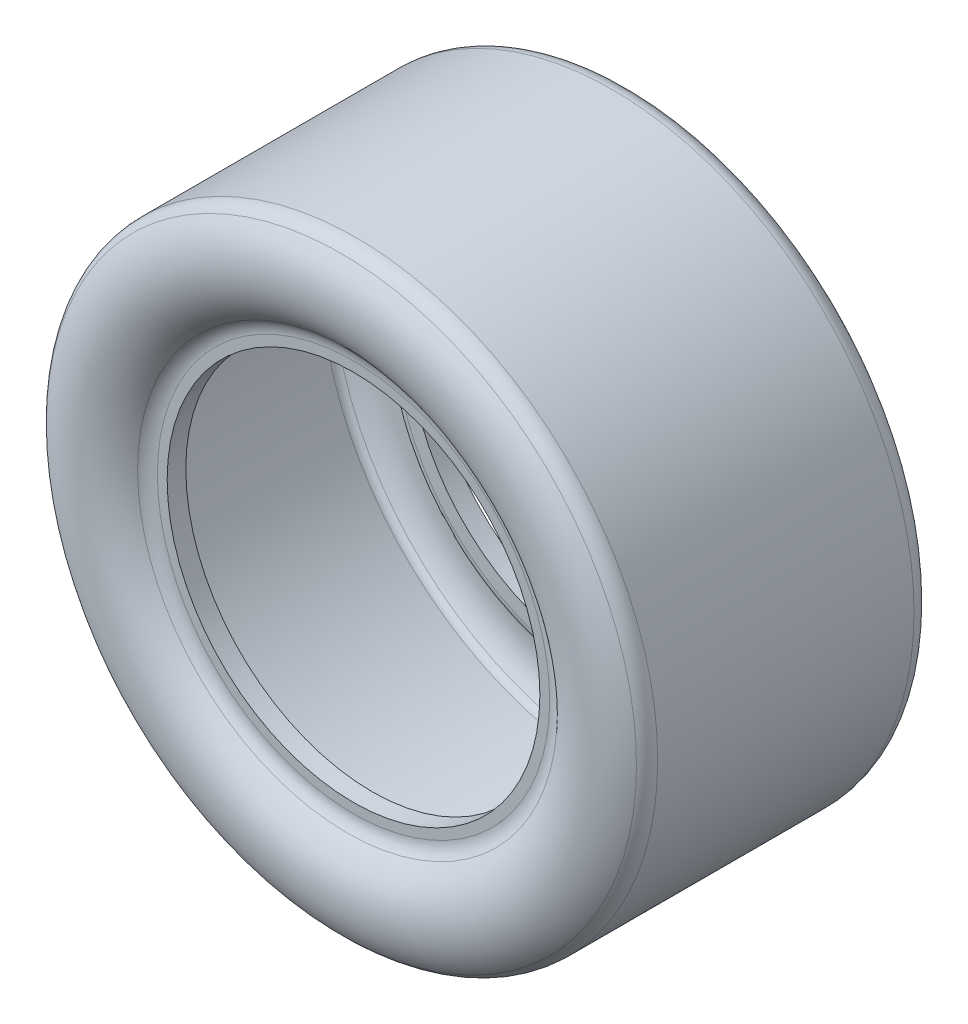
ISO-10303-21;
HEADER;
FILE_DESCRIPTION(('STEP AP214'),'2;1');
FILE_NAME('part.step','',(''),(''),'','','');
FILE_SCHEMA(('AUTOMOTIVE_DESIGN { 1 0 10303 214 1 1 1 1 }'));
ENDSEC;
DATA;
#1=APPLICATION_CONTEXT('core data for automotive mechanical design processes');
#2=APPLICATION_PROTOCOL_DEFINITION('international standard','automotive_design',2000,#1);
#3=PRODUCT_CONTEXT('',#1,'mechanical');
#4=PRODUCT('Part','Part','',(#3));
#5=PRODUCT_RELATED_PRODUCT_CATEGORY('part','',(#4));
#6=PRODUCT_DEFINITION_FORMATION('','',#4);
#7=PRODUCT_DEFINITION_CONTEXT('part definition',#1,'design');
#8=PRODUCT_DEFINITION('design','',#6,#7);
#9=PRODUCT_DEFINITION_SHAPE('','',#8);
#10=(LENGTH_UNIT() NAMED_UNIT(*) SI_UNIT(.MILLI.,.METRE.));
#11=(NAMED_UNIT(*) PLANE_ANGLE_UNIT() SI_UNIT($,.RADIAN.));
#12=(NAMED_UNIT(*) SI_UNIT($,.STERADIAN.) SOLID_ANGLE_UNIT());
#13=UNCERTAINTY_MEASURE_WITH_UNIT(LENGTH_MEASURE(1.E-05),#10,'distance_accuracy_value','');
#14=(GEOMETRIC_REPRESENTATION_CONTEXT(3) GLOBAL_UNCERTAINTY_ASSIGNED_CONTEXT((#13)) GLOBAL_UNIT_ASSIGNED_CONTEXT((#10,
#11,#12)) REPRESENTATION_CONTEXT('',''));
#15=CARTESIAN_POINT('',(0.,0.,0.));
#16=DIRECTION('',(0.,0.,1.));
#17=DIRECTION('',(1.,0.,0.));
#18=AXIS2_PLACEMENT_3D('',#15,#16,#17);
#19=CARTESIAN_POINT('',(0.,0.,64.4017));
#20=DIRECTION('',(0.,0.,-1.));
#21=DIRECTION('',(-1.,0.,0.));
#22=AXIS2_PLACEMENT_3D('',#19,#20,#21);
#23=TOROIDAL_SURFACE('',#22,174.243267307692,42.3486011478618);
#24=CARTESIAN_POINT('',(0.,0.,97.1518352972636));
#25=DIRECTION('',(0.,0.,-1.));
#26=DIRECTION('',(-1.,0.,0.));
#27=AXIS2_PLACEMENT_3D('',#24,#25,#26);
#28=CIRCLE('',#27,201.091594205129);
#29=CARTESIAN_POINT('',(-201.091594205129,0.,97.1518352972636));
#30=VERTEX_POINT('',#29);
#31=EDGE_CURVE('E47',#30,#30,#28,.F.);
#32=ORIENTED_EDGE('',*,*,#31,.T.);
#33=EDGE_LOOP('',(#32));
#34=FACE_BOUND('',#33,.T.);
#35=CARTESIAN_POINT('',(0.,0.,93.0181577706021));
#36=DIRECTION('',(0.,0.,-1.));
#37=DIRECTION('',(-1.,0.,0.));
#38=AXIS2_PLACEMENT_3D('',#35,#36,#37);
#39=CIRCLE('',#38,143.026246888632);
#40=CARTESIAN_POINT('',(-143.026246888632,0.,93.0181577706021));
#41=VERTEX_POINT('',#40);
#42=EDGE_CURVE('E51',#41,#41,#39,.T.);
#43=ORIENTED_EDGE('',*,*,#42,.T.);
#44=EDGE_LOOP('',(#43));
#45=FACE_BOUND('',#44,.T.);
#46=ADVANCED_FACE('F36',(#34,#45),#23,.T.);
#47=CARTESIAN_POINT('',(0.,127.,88.9));
#48=DIRECTION('',(0.,0.,1.));
#49=DIRECTION('',(1.,0.,0.));
#50=AXIS2_PLACEMENT_3D('',#47,#48,#49);
#51=PLANE('',#50);
#52=CARTESIAN_POINT('',(0.,0.,88.9));
#53=DIRECTION('',(0.,0.,1.));
#54=DIRECTION('',(1.,0.,0.));
#55=AXIS2_PLACEMENT_3D('',#52,#53,#54);
#56=CIRCLE('',#55,133.664517136619);
#57=CARTESIAN_POINT('',(133.664517136619,0.,88.9));
#58=VERTEX_POINT('',#57);
#59=EDGE_CURVE('E10',#58,#58,#56,.T.);
#60=ORIENTED_EDGE('',*,*,#59,.T.);
#61=EDGE_LOOP('',(#60));
#62=FACE_BOUND('',#61,.T.);
#63=CARTESIAN_POINT('',(0.,0.,88.9));
#64=DIRECTION('',(0.,0.,-1.));
#65=DIRECTION('',(-1.,0.,0.));
#66=AXIS2_PLACEMENT_3D('',#63,#64,#65);
#67=CIRCLE('',#66,127.);
#68=CARTESIAN_POINT('',(-127.,0.,88.9));
#69=VERTEX_POINT('',#68);
#70=EDGE_CURVE('E68',#69,#69,#67,.T.);
#71=ORIENTED_EDGE('',*,*,#70,.T.);
#72=EDGE_LOOP('',(#71));
#73=FACE_BOUND('',#72,.T.);
#74=ADVANCED_FACE('F122',(#62,#73),#51,.T.);
#75=CARTESIAN_POINT('',(0.,0.,0.));
#76=DIRECTION('',(0.,0.,-1.));
#77=DIRECTION('',(-1.,0.,0.));
#78=AXIS2_PLACEMENT_3D('',#75,#76,#77);
#79=CYLINDRICAL_SURFACE('',#78,127.);
#80=CARTESIAN_POINT('',(0.,0.,76.2));
#81=DIRECTION('',(0.,0.,-1.));
#82=DIRECTION('',(-1.,0.,0.));
#83=AXIS2_PLACEMENT_3D('',#80,#81,#82);
#84=CIRCLE('',#83,127.);
#85=CARTESIAN_POINT('',(-127.,0.,76.2));
#86=VERTEX_POINT('',#85);
#87=EDGE_CURVE('E71',#86,#86,#84,.T.);
#88=ORIENTED_EDGE('',*,*,#87,.T.);
#89=EDGE_LOOP('',(#88));
#90=FACE_BOUND('',#89,.T.);
#91=ORIENTED_EDGE('',*,*,#70,.F.);
#92=EDGE_LOOP('',(#91));
#93=FACE_BOUND('',#92,.T.);
#94=ADVANCED_FACE('F128',(#90,#93),#79,.F.);
#95=CARTESIAN_POINT('',(0.,127.,76.2));
#96=DIRECTION('',(0.,0.,-1.));
#97=DIRECTION('',(-1.,0.,0.));
#98=AXIS2_PLACEMENT_3D('',#95,#96,#97);
#99=PLANE('',#98);
#100=CARTESIAN_POINT('',(0.,0.,76.2));
#101=DIRECTION('',(0.,0.,-1.));
#102=DIRECTION('',(-1.,0.,0.));
#103=AXIS2_PLACEMENT_3D('',#100,#101,#102);
#104=CIRCLE('',#103,136.774584150412);
#105=CARTESIAN_POINT('',(-136.774584150412,0.,76.2));
#106=VERTEX_POINT('',#105);
#107=EDGE_CURVE('E74',#106,#106,#104,.T.);
#108=ORIENTED_EDGE('',*,*,#107,.T.);
#109=EDGE_LOOP('',(#108));
#110=FACE_BOUND('',#109,.T.);
#111=ORIENTED_EDGE('',*,*,#87,.F.);
#112=EDGE_LOOP('',(#111));
#113=FACE_BOUND('',#112,.T.);
#114=ADVANCED_FACE('F286',(#110,#113),#99,.T.);
#115=CARTESIAN_POINT('',(0.,0.,84.1375));
#116=DIRECTION('',(0.,0.,-1.));
#117=DIRECTION('',(-1.,0.,0.));
#118=AXIS2_PLACEMENT_3D('',#115,#116,#117);
#119=TOROIDAL_SURFACE('',#118,136.774584150412,7.93749999999999);
#120=CARTESIAN_POINT('',(0.,0.,80.4383716166789));
#121=DIRECTION('',(0.,0.,-1.));
#122=DIRECTION('',(-1.,0.,0.));
#123=AXIS2_PLACEMENT_3D('',#120,#121,#122);
#124=CIRCLE('',#123,143.797429403848);
#125=CARTESIAN_POINT('',(-143.797429403848,0.,80.4383716166789));
#126=VERTEX_POINT('',#125);
#127=EDGE_CURVE('E77',#126,#126,#124,.T.);
#128=ORIENTED_EDGE('',*,*,#127,.T.);
#129=EDGE_LOOP('',(#128));
#130=FACE_BOUND('',#129,.T.);
#131=ORIENTED_EDGE('',*,*,#107,.F.);
#132=EDGE_LOOP('',(#131));
#133=FACE_BOUND('',#132,.T.);
#134=ADVANCED_FACE('F276',(#130,#133),#119,.T.);
#135=CARTESIAN_POINT('',(0.,0.,64.4017));
#136=DIRECTION('',(0.,0.,-1.));
#137=DIRECTION('',(-1.,0.,0.));
#138=AXIS2_PLACEMENT_3D('',#135,#136,#137);
#139=TOROIDAL_SURFACE('',#138,174.243267307692,34.4111011478618);
#140=CARTESIAN_POINT('',(0.,0.,91.5819201400496));
#141=DIRECTION('',(0.,0.,-1.));
#142=DIRECTION('',(-1.,0.,0.));
#143=AXIS2_PLACEMENT_3D('',#140,#141,#142);
#144=CIRCLE('',#143,195.346810027976);
#145=CARTESIAN_POINT('',(-195.346810027976,0.,91.5819201400496));
#146=VERTEX_POINT('',#145);
#147=EDGE_CURVE('E80',#146,#146,#144,.T.);
#148=ORIENTED_EDGE('',*,*,#147,.T.);
#149=EDGE_LOOP('',(#148));
#150=FACE_BOUND('',#149,.T.);
#151=ORIENTED_EDGE('',*,*,#127,.F.);
#152=EDGE_LOOP('',(#151));
#153=FACE_BOUND('',#152,.T.);
#154=ADVANCED_FACE('F266',(#150,#153),#139,.F.);
#155=CARTESIAN_POINT('',(0.,0.,86.5662597243108));
#156=DIRECTION('',(0.,0.,-1.));
#157=DIRECTION('',(-1.,0.,0.));
#158=AXIS2_PLACEMENT_3D('',#155,#156,#157);
#159=TOROIDAL_SURFACE('',#158,191.4525,6.35000000000001);
#160=CARTESIAN_POINT('',(0.,0.,86.5662597243108));
#161=DIRECTION('',(0.,0.,-1.));
#162=DIRECTION('',(-1.,0.,0.));
#163=AXIS2_PLACEMENT_3D('',#160,#161,#162);
#164=CIRCLE('',#163,197.8025);
#165=CARTESIAN_POINT('',(-197.8025,0.,86.5662597243108));
#166=VERTEX_POINT('',#165);
#167=EDGE_CURVE('E83',#166,#166,#164,.T.);
#168=ORIENTED_EDGE('',*,*,#167,.T.);
#169=EDGE_LOOP('',(#168));
#170=FACE_BOUND('',#169,.T.);
#171=ORIENTED_EDGE('',*,*,#147,.F.);
#172=EDGE_LOOP('',(#171));
#173=FACE_BOUND('',#172,.T.);
#174=ADVANCED_FACE('F256',(#170,#173),#159,.F.);
#175=CARTESIAN_POINT('',(0.,0.,0.));
#176=DIRECTION('',(0.,0.,-1.));
#177=DIRECTION('',(-1.,0.,0.));
#178=AXIS2_PLACEMENT_3D('',#175,#176,#177);
#179=CYLINDRICAL_SURFACE('',#178,197.8025);
#180=CARTESIAN_POINT('',(0.,0.,-86.5662597243108));
#181=DIRECTION('',(0.,0.,-1.));
#182=DIRECTION('',(-1.,0.,0.));
#183=AXIS2_PLACEMENT_3D('',#180,#181,#182);
#184=CIRCLE('',#183,197.8025);
#185=CARTESIAN_POINT('',(-197.8025,0.,-86.5662597243108));
#186=VERTEX_POINT('',#185);
#187=EDGE_CURVE('E86',#186,#186,#184,.T.);
#188=ORIENTED_EDGE('',*,*,#187,.T.);
#189=EDGE_LOOP('',(#188));
#190=FACE_BOUND('',#189,.T.);
#191=ORIENTED_EDGE('',*,*,#167,.F.);
#192=EDGE_LOOP('',(#191));
#193=FACE_BOUND('',#192,.T.);
#194=ADVANCED_FACE('F246',(#190,#193),#179,.F.);
#195=CARTESIAN_POINT('',(0.,0.,-86.5662597243107));
#196=DIRECTION('',(0.,0.,-1.));
#197=DIRECTION('',(-1.,0.,0.));
#198=AXIS2_PLACEMENT_3D('',#195,#196,#197);
#199=TOROIDAL_SURFACE('',#198,191.4525,6.35000000000012);
#200=CARTESIAN_POINT('',(0.,0.,-91.5819201400496));
#201=DIRECTION('',(0.,0.,-1.));
#202=DIRECTION('',(-1.,0.,0.));
#203=AXIS2_PLACEMENT_3D('',#200,#201,#202);
#204=CIRCLE('',#203,195.346810027975);
#205=CARTESIAN_POINT('',(-195.346810027975,0.,-91.5819201400496));
#206=VERTEX_POINT('',#205);
#207=EDGE_CURVE('E89',#206,#206,#204,.T.);
#208=ORIENTED_EDGE('',*,*,#207,.T.);
#209=EDGE_LOOP('',(#208));
#210=FACE_BOUND('',#209,.T.);
#211=ORIENTED_EDGE('',*,*,#187,.F.);
#212=EDGE_LOOP('',(#211));
#213=FACE_BOUND('',#212,.T.);
#214=ADVANCED_FACE('F236',(#210,#213),#199,.F.);
#215=CARTESIAN_POINT('',(0.,0.,-64.4017));
#216=DIRECTION('',(0.,0.,-1.));
#217=DIRECTION('',(-1.,0.,0.));
#218=AXIS2_PLACEMENT_3D('',#215,#216,#217);
#219=TOROIDAL_SURFACE('',#218,174.243267307692,34.4111011478618);
#220=CARTESIAN_POINT('',(0.,0.,-80.4383716166789));
#221=DIRECTION('',(0.,0.,-1.));
#222=DIRECTION('',(-1.,0.,0.));
#223=AXIS2_PLACEMENT_3D('',#220,#221,#222);
#224=CIRCLE('',#223,143.797429403848);
#225=CARTESIAN_POINT('',(-143.797429403848,0.,-80.4383716166789));
#226=VERTEX_POINT('',#225);
#227=EDGE_CURVE('E92',#226,#226,#224,.T.);
#228=ORIENTED_EDGE('',*,*,#227,.T.);
#229=EDGE_LOOP('',(#228));
#230=FACE_BOUND('',#229,.T.);
#231=ORIENTED_EDGE('',*,*,#207,.F.);
#232=EDGE_LOOP('',(#231));
#233=FACE_BOUND('',#232,.T.);
#234=ADVANCED_FACE('F226',(#230,#233),#219,.F.);
#235=CARTESIAN_POINT('',(0.,0.,-84.1375));
#236=DIRECTION('',(0.,0.,-1.));
#237=DIRECTION('',(-1.,0.,0.));
#238=AXIS2_PLACEMENT_3D('',#235,#236,#237);
#239=TOROIDAL_SURFACE('',#238,136.774584150412,7.93749999999999);
#240=CARTESIAN_POINT('',(0.,0.,-76.2));
#241=DIRECTION('',(0.,0.,-1.));
#242=DIRECTION('',(-1.,0.,0.));
#243=AXIS2_PLACEMENT_3D('',#240,#241,#242);
#244=CIRCLE('',#243,136.774584150412);
#245=CARTESIAN_POINT('',(-136.774584150412,0.,-76.2));
#246=VERTEX_POINT('',#245);
#247=EDGE_CURVE('E95',#246,#246,#244,.T.);
#248=ORIENTED_EDGE('',*,*,#247,.T.);
#249=EDGE_LOOP('',(#248));
#250=FACE_BOUND('',#249,.T.);
#251=ORIENTED_EDGE('',*,*,#227,.F.);
#252=EDGE_LOOP('',(#251));
#253=FACE_BOUND('',#252,.T.);
#254=ADVANCED_FACE('F216',(#250,#253),#239,.T.);
#255=CARTESIAN_POINT('',(0.,127.,-76.2));
#256=DIRECTION('',(0.,0.,1.));
#257=DIRECTION('',(1.,0.,0.));
#258=AXIS2_PLACEMENT_3D('',#255,#256,#257);
#259=PLANE('',#258);
#260=CARTESIAN_POINT('',(0.,0.,-76.2));
#261=DIRECTION('',(0.,0.,-1.));
#262=DIRECTION('',(-1.,0.,0.));
#263=AXIS2_PLACEMENT_3D('',#260,#261,#262);
#264=CIRCLE('',#263,127.);
#265=CARTESIAN_POINT('',(-127.,0.,-76.2));
#266=VERTEX_POINT('',#265);
#267=EDGE_CURVE('E98',#266,#266,#264,.T.);
#268=ORIENTED_EDGE('',*,*,#267,.T.);
#269=EDGE_LOOP('',(#268));
#270=FACE_BOUND('',#269,.T.);
#271=ORIENTED_EDGE('',*,*,#247,.F.);
#272=EDGE_LOOP('',(#271));
#273=FACE_BOUND('',#272,.T.);
#274=ADVANCED_FACE('F119',(#270,#273),#259,.T.);
#275=CARTESIAN_POINT('',(0.,0.,0.));
#276=DIRECTION('',(0.,0.,-1.));
#277=DIRECTION('',(-1.,0.,0.));
#278=AXIS2_PLACEMENT_3D('',#275,#276,#277);
#279=CYLINDRICAL_SURFACE('',#278,127.);
#280=CARTESIAN_POINT('',(0.,0.,-88.9));
#281=DIRECTION('',(0.,0.,-1.));
#282=DIRECTION('',(-1.,0.,0.));
#283=AXIS2_PLACEMENT_3D('',#280,#281,#282);
#284=CIRCLE('',#283,127.);
#285=CARTESIAN_POINT('',(-127.,0.,-88.9));
#286=VERTEX_POINT('',#285);
#287=EDGE_CURVE('E101',#286,#286,#284,.T.);
#288=ORIENTED_EDGE('',*,*,#287,.T.);
#289=EDGE_LOOP('',(#288));
#290=FACE_BOUND('',#289,.T.);
#291=ORIENTED_EDGE('',*,*,#267,.F.);
#292=EDGE_LOOP('',(#291));
#293=FACE_BOUND('',#292,.T.);
#294=ADVANCED_FACE('F105',(#290,#293),#279,.F.);
#295=CARTESIAN_POINT('',(0.,127.,-88.9));
#296=DIRECTION('',(0.,0.,-1.));
#297=DIRECTION('',(-1.,0.,0.));
#298=AXIS2_PLACEMENT_3D('',#295,#296,#297);
#299=PLANE('',#298);
#300=CARTESIAN_POINT('',(0.,0.,-88.9));
#301=DIRECTION('',(0.,0.,-1.));
#302=DIRECTION('',(-1.,0.,0.));
#303=AXIS2_PLACEMENT_3D('',#300,#301,#302);
#304=CIRCLE('',#303,133.664517136619);
#305=CARTESIAN_POINT('',(-133.664517136619,0.,-88.9));
#306=VERTEX_POINT('',#305);
#307=EDGE_CURVE('E43',#306,#306,#304,.T.);
#308=ORIENTED_EDGE('',*,*,#307,.T.);
#309=EDGE_LOOP('',(#308));
#310=FACE_BOUND('',#309,.T.);
#311=ORIENTED_EDGE('',*,*,#287,.F.);
#312=EDGE_LOOP('',(#311));
#313=FACE_BOUND('',#312,.T.);
#314=ADVANCED_FACE('F108',(#310,#313),#299,.T.);
#315=CARTESIAN_POINT('',(0.,0.,-64.4017));
#316=DIRECTION('',(0.,0.,-1.));
#317=DIRECTION('',(-1.,0.,0.));
#318=AXIS2_PLACEMENT_3D('',#315,#316,#317);
#319=TOROIDAL_SURFACE('',#318,174.243267307692,42.3486011478618);
#320=CARTESIAN_POINT('',(0.,0.,-97.1518352972635));
#321=DIRECTION('',(0.,0.,1.));
#322=DIRECTION('',(1.,0.,0.));
#323=AXIS2_PLACEMENT_3D('',#320,#321,#322);
#324=CIRCLE('',#323,201.091594205129);
#325=CARTESIAN_POINT('',(201.091594205129,0.,-97.1518352972635));
#326=VERTEX_POINT('',#325);
#327=EDGE_CURVE('E62',#326,#326,#324,.F.);
#328=ORIENTED_EDGE('',*,*,#327,.T.);
#329=EDGE_LOOP('',(#328));
#330=FACE_BOUND('',#329,.T.);
#331=CARTESIAN_POINT('',(0.,0.,-93.0181577706021));
#332=DIRECTION('',(0.,0.,1.));
#333=DIRECTION('',(1.,0.,0.));
#334=AXIS2_PLACEMENT_3D('',#331,#332,#333);
#335=CIRCLE('',#334,143.026246888632);
#336=CARTESIAN_POINT('',(143.026246888632,0.,-93.0181577706021));
#337=VERTEX_POINT('',#336);
#338=EDGE_CURVE('E65',#337,#337,#335,.T.);
#339=ORIENTED_EDGE('',*,*,#338,.T.);
#340=EDGE_LOOP('',(#339));
#341=FACE_BOUND('',#340,.T.);
#342=ADVANCED_FACE('F110',(#330,#341),#319,.T.);
#343=CARTESIAN_POINT('',(0.,0.,0.));
#344=DIRECTION('',(0.,0.,-1.));
#345=DIRECTION('',(-1.,0.,0.));
#346=AXIS2_PLACEMENT_3D('',#343,#344,#345);
#347=CYLINDRICAL_SURFACE('',#346,205.74);
#348=CARTESIAN_POINT('',(0.,0.,-87.3303369005862));
#349=DIRECTION('',(0.,0.,1.));
#350=DIRECTION('',(1.,0.,0.));
#351=AXIS2_PLACEMENT_3D('',#348,#349,#350);
#352=CIRCLE('',#351,205.74);
#353=CARTESIAN_POINT('',(205.74,0.,-87.3303369005862));
#354=VERTEX_POINT('',#353);
#355=EDGE_CURVE('E56',#354,#354,#352,.T.);
#356=ORIENTED_EDGE('',*,*,#355,.T.);
#357=EDGE_LOOP('',(#356));
#358=FACE_BOUND('',#357,.T.);
#359=CARTESIAN_POINT('',(0.,0.,87.3303369005863));
#360=DIRECTION('',(0.,0.,1.));
#361=DIRECTION('',(1.,0.,0.));
#362=AXIS2_PLACEMENT_3D('',#359,#360,#361);
#363=CIRCLE('',#362,205.74);
#364=CARTESIAN_POINT('',(205.74,0.,87.3303369005863));
#365=VERTEX_POINT('',#364);
#366=EDGE_CURVE('E59',#365,#365,#363,.F.);
#367=ORIENTED_EDGE('',*,*,#366,.T.);
#368=EDGE_LOOP('',(#367));
#369=FACE_BOUND('',#368,.T.);
#370=ADVANCED_FACE('F116',(#358,#369),#347,.T.);
#371=CARTESIAN_POINT('',(0.,0.,-87.3303369005862));
#372=DIRECTION('',(0.,0.,1.));
#373=DIRECTION('',(1.,0.,0.));
#374=AXIS2_PLACEMENT_3D('',#371,#372,#373);
#375=TOROIDAL_SURFACE('',#374,193.04,12.7);
#376=ORIENTED_EDGE('',*,*,#355,.F.);
#377=EDGE_LOOP('',(#376));
#378=FACE_BOUND('',#377,.T.);
#379=ORIENTED_EDGE('',*,*,#327,.F.);
#380=EDGE_LOOP('',(#379));
#381=FACE_BOUND('',#380,.T.);
#382=ADVANCED_FACE('F133',(#378,#381),#375,.T.);
#383=CARTESIAN_POINT('',(0.,0.,87.3303369005863));
#384=DIRECTION('',(0.,0.,1.));
#385=DIRECTION('',(1.,0.,0.));
#386=AXIS2_PLACEMENT_3D('',#383,#384,#385);
#387=TOROIDAL_SURFACE('',#386,193.04,12.7);
#388=ORIENTED_EDGE('',*,*,#31,.F.);
#389=EDGE_LOOP('',(#388));
#390=FACE_BOUND('',#389,.T.);
#391=ORIENTED_EDGE('',*,*,#366,.F.);
#392=EDGE_LOOP('',(#391));
#393=FACE_BOUND('',#392,.T.);
#394=ADVANCED_FACE('F136',(#390,#393),#387,.T.);
#395=CARTESIAN_POINT('',(0.,0.,-101.6));
#396=DIRECTION('',(0.,0.,1.));
#397=DIRECTION('',(1.,0.,0.));
#398=AXIS2_PLACEMENT_3D('',#395,#396,#397);
#399=TOROIDAL_SURFACE('',#398,133.664517136619,12.7);
#400=ORIENTED_EDGE('',*,*,#338,.F.);
#401=EDGE_LOOP('',(#400));
#402=FACE_BOUND('',#401,.T.);
#403=ORIENTED_EDGE('',*,*,#307,.F.);
#404=EDGE_LOOP('',(#403));
#405=FACE_BOUND('',#404,.T.);
#406=ADVANCED_FACE('F139',(#402,#405),#399,.F.);
#407=CARTESIAN_POINT('',(0.,0.,101.6));
#408=DIRECTION('',(0.,0.,-1.));
#409=DIRECTION('',(-1.,0.,0.));
#410=AXIS2_PLACEMENT_3D('',#407,#408,#409);
#411=TOROIDAL_SURFACE('',#410,133.664517136619,12.7);
#412=ORIENTED_EDGE('',*,*,#59,.F.);
#413=EDGE_LOOP('',(#412));
#414=FACE_BOUND('',#413,.T.);
#415=ORIENTED_EDGE('',*,*,#42,.F.);
#416=EDGE_LOOP('',(#415));
#417=FACE_BOUND('',#416,.T.);
#418=ADVANCED_FACE('F38',(#414,#417),#411,.F.);
#419=CLOSED_SHELL('',(#46,#74,#94,#114,#134,#154,#174,#194,#214,#234,#254,#274,#294,#314,#342,
#370,#382,#394,#406,#418));
#420=MANIFOLD_SOLID_BREP('B2',#419);
#421=ADVANCED_BREP_SHAPE_REPRESENTATION('',(#18,#420),#14);
#422=SHAPE_DEFINITION_REPRESENTATION(#9,#421);
ENDSEC;
END-ISO-10303-21;
